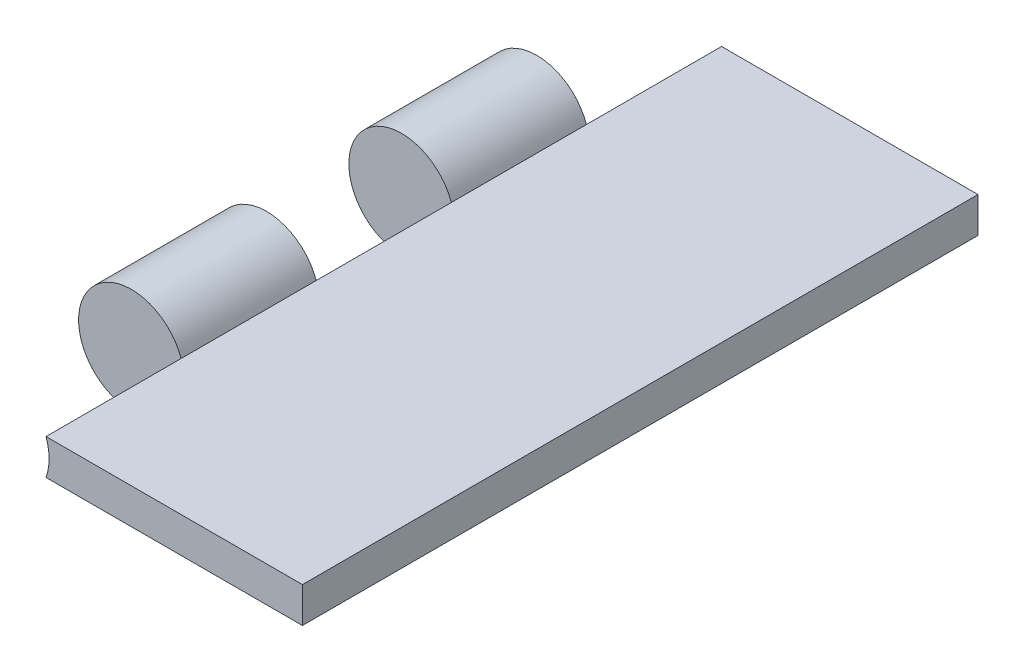
ISO-10303-21;
HEADER;
FILE_DESCRIPTION(('STEP AP214'),'2;1');
FILE_NAME('part.step','',(''),(''),'','','');
FILE_SCHEMA(('AUTOMOTIVE_DESIGN { 1 0 10303 214 1 1 1 1 }'));
ENDSEC;
DATA;
#1=APPLICATION_CONTEXT('core data for automotive mechanical design processes');
#2=APPLICATION_PROTOCOL_DEFINITION('international standard','automotive_design',2000,#1);
#3=PRODUCT_CONTEXT('',#1,'mechanical');
#4=PRODUCT('Part','Part','',(#3));
#5=PRODUCT_RELATED_PRODUCT_CATEGORY('part','',(#4));
#6=PRODUCT_DEFINITION_FORMATION('','',#4);
#7=PRODUCT_DEFINITION_CONTEXT('part definition',#1,'design');
#8=PRODUCT_DEFINITION('design','',#6,#7);
#9=PRODUCT_DEFINITION_SHAPE('','',#8);
#10=(LENGTH_UNIT() NAMED_UNIT(*) SI_UNIT(.MILLI.,.METRE.));
#11=(NAMED_UNIT(*) PLANE_ANGLE_UNIT() SI_UNIT($,.RADIAN.));
#12=(NAMED_UNIT(*) SI_UNIT($,.STERADIAN.) SOLID_ANGLE_UNIT());
#13=UNCERTAINTY_MEASURE_WITH_UNIT(LENGTH_MEASURE(1.E-05),#10,'distance_accuracy_value','');
#14=(GEOMETRIC_REPRESENTATION_CONTEXT(3) GLOBAL_UNCERTAINTY_ASSIGNED_CONTEXT((#13)) GLOBAL_UNIT_ASSIGNED_CONTEXT((#10,
#11,#12)) REPRESENTATION_CONTEXT('',''));
#15=CARTESIAN_POINT('',(0.,0.,0.));
#16=DIRECTION('',(0.,0.,1.));
#17=DIRECTION('',(1.,0.,0.));
#18=AXIS2_PLACEMENT_3D('',#15,#16,#17);
#19=CARTESIAN_POINT('',(0.,0.,101.6));
#20=DIRECTION('',(0.,0.,-1.));
#21=DIRECTION('',(-1.,0.,0.));
#22=AXIS2_PLACEMENT_3D('',#19,#20,#21);
#23=CYLINDRICAL_SURFACE('',#22,7.9375);
#24=CARTESIAN_POINT('',(0.,0.,81.28));
#25=DIRECTION('',(0.,0.,1.));
#26=DIRECTION('',(1.,0.,0.));
#27=AXIS2_PLACEMENT_3D('',#24,#25,#26);
#28=CIRCLE('',#27,7.9375);
#29=CARTESIAN_POINT('',(7.47602951104395,2.66699999999999,81.28));
#30=VERTEX_POINT('',#29);
#31=CARTESIAN_POINT('',(7.47602951104395,-2.66699999999999,81.28));
#32=VERTEX_POINT('',#31);
#33=EDGE_CURVE('E225',#30,#32,#28,.T.);
#34=ORIENTED_EDGE('',*,*,#33,.F.);
#35=DIRECTION('',(0.,0.,-1.));
#36=VECTOR('',#35,1.);
#37=CARTESIAN_POINT('',(7.47602951104395,2.66699999999999,101.6));
#38=LINE('',#37,#36);
#39=CARTESIAN_POINT('',(7.47602951104395,2.66699999999999,60.96));
#40=VERTEX_POINT('',#39);
#41=EDGE_CURVE('E128',#30,#40,#38,.T.);
#42=ORIENTED_EDGE('',*,*,#41,.T.);
#43=CARTESIAN_POINT('',(0.,0.,60.96));
#44=DIRECTION('',(0.,0.,1.));
#45=DIRECTION('',(1.,0.,0.));
#46=AXIS2_PLACEMENT_3D('',#43,#44,#45);
#47=CIRCLE('',#46,7.9375);
#48=CARTESIAN_POINT('',(7.47602951104395,-2.66699999999999,60.96));
#49=VERTEX_POINT('',#48);
#50=EDGE_CURVE('E164',#40,#49,#47,.T.);
#51=ORIENTED_EDGE('',*,*,#50,.T.);
#52=DIRECTION('',(0.,0.,-1.));
#53=VECTOR('',#52,1.);
#54=CARTESIAN_POINT('',(7.47602951104395,-2.66699999999999,101.6));
#55=LINE('',#54,#53);
#56=EDGE_CURVE('E52',#32,#49,#55,.T.);
#57=ORIENTED_EDGE('',*,*,#56,.F.);
#58=EDGE_LOOP('',(#34,#42,#51,#57));
#59=FACE_BOUND('',#58,.T.);
#60=ADVANCED_FACE('F37',(#59),#23,.T.);
#61=CARTESIAN_POINT('',(0.,0.,101.6));
#62=DIRECTION('',(0.,0.,1.));
#63=DIRECTION('',(1.,0.,0.));
#64=AXIS2_PLACEMENT_3D('',#61,#62,#63);
#65=PLANE('',#64);
#66=DIRECTION('',(-1.,0.,0.));
#67=VECTOR('',#66,1.);
#68=CARTESIAN_POINT('',(0.,2.66699999999999,101.6));
#69=LINE('',#68,#67);
#70=CARTESIAN_POINT('',(46.0375,2.667,101.6));
#71=VERTEX_POINT('',#70);
#72=CARTESIAN_POINT('',(7.47602951104395,2.66699999999999,101.6));
#73=VERTEX_POINT('',#72);
#74=EDGE_CURVE('E116',#71,#73,#69,.T.);
#75=ORIENTED_EDGE('',*,*,#74,.T.);
#76=CARTESIAN_POINT('',(0.,0.,101.6));
#77=DIRECTION('',(0.,0.,1.));
#78=DIRECTION('',(1.,0.,0.));
#79=AXIS2_PLACEMENT_3D('',#76,#77,#78);
#80=CIRCLE('',#79,7.9375);
#81=CARTESIAN_POINT('',(7.47602951104395,-2.66699999999999,101.6));
#82=VERTEX_POINT('',#81);
#83=EDGE_CURVE('E11',#73,#82,#80,.F.);
#84=ORIENTED_EDGE('',*,*,#83,.T.);
#85=DIRECTION('',(-1.,0.,0.));
#86=VECTOR('',#85,1.);
#87=CARTESIAN_POINT('',(0.,-2.66699999999999,101.6));
#88=LINE('',#87,#86);
#89=CARTESIAN_POINT('',(46.0375,-2.667,101.6));
#90=VERTEX_POINT('',#89);
#91=EDGE_CURVE('E167',#90,#82,#88,.T.);
#92=ORIENTED_EDGE('',*,*,#91,.F.);
#93=DIRECTION('',(0.,1.,0.));
#94=VECTOR('',#93,1.);
#95=CARTESIAN_POINT('',(46.0375,0.,101.6));
#96=LINE('',#95,#94);
#97=EDGE_CURVE('E118',#90,#71,#96,.T.);
#98=ORIENTED_EDGE('',*,*,#97,.T.);
#99=EDGE_LOOP('',(#75,#84,#92,#98));
#100=FACE_BOUND('',#99,.T.);
#101=ADVANCED_FACE('F117',(#100),#65,.T.);
#102=CARTESIAN_POINT('',(0.,0.,40.64));
#103=DIRECTION('',(0.,0.,1.));
#104=DIRECTION('',(1.,0.,0.));
#105=AXIS2_PLACEMENT_3D('',#102,#103,#104);
#106=CIRCLE('',#105,7.9375);
#107=CARTESIAN_POINT('',(7.47602951104395,2.66699999999999,40.64));
#108=VERTEX_POINT('',#107);
#109=CARTESIAN_POINT('',(7.47602951104395,-2.66699999999999,40.64));
#110=VERTEX_POINT('',#109);
#111=EDGE_CURVE('E159',#108,#110,#106,.T.);
#112=ORIENTED_EDGE('',*,*,#111,.F.);
#113=CARTESIAN_POINT('',(7.47602951104395,2.66699999999999,20.32));
#114=VERTEX_POINT('',#113);
#115=EDGE_CURVE('E133',#108,#114,#38,.T.);
#116=ORIENTED_EDGE('',*,*,#115,.T.);
#117=CARTESIAN_POINT('',(0.,0.,20.32));
#118=DIRECTION('',(0.,0.,1.));
#119=DIRECTION('',(1.,0.,0.));
#120=AXIS2_PLACEMENT_3D('',#117,#118,#119);
#121=CIRCLE('',#120,7.9375);
#122=CARTESIAN_POINT('',(7.47602951104395,-2.66699999999999,20.32));
#123=VERTEX_POINT('',#122);
#124=EDGE_CURVE('E158',#114,#123,#121,.T.);
#125=ORIENTED_EDGE('',*,*,#124,.T.);
#126=EDGE_CURVE('E122',#110,#123,#55,.T.);
#127=ORIENTED_EDGE('',*,*,#126,.F.);
#128=EDGE_LOOP('',(#112,#116,#125,#127));
#129=FACE_BOUND('',#128,.T.);
#130=ADVANCED_FACE('F161',(#129),#23,.T.);
#131=CARTESIAN_POINT('',(0.,0.,0.));
#132=DIRECTION('',(0.,0.,1.));
#133=DIRECTION('',(1.,0.,0.));
#134=AXIS2_PLACEMENT_3D('',#131,#132,#133);
#135=PLANE('',#134);
#136=CARTESIAN_POINT('',(0.,0.,0.));
#137=DIRECTION('',(0.,0.,1.));
#138=DIRECTION('',(1.,0.,0.));
#139=AXIS2_PLACEMENT_3D('',#136,#137,#138);
#140=CIRCLE('',#139,7.9375);
#141=CARTESIAN_POINT('',(7.47602951104395,2.66699999999999,0.));
#142=VERTEX_POINT('',#141);
#143=CARTESIAN_POINT('',(7.47602951104395,-2.66699999999999,0.));
#144=VERTEX_POINT('',#143);
#145=EDGE_CURVE('E45',#142,#144,#140,.F.);
#146=ORIENTED_EDGE('',*,*,#145,.F.);
#147=DIRECTION('',(-1.,0.,0.));
#148=VECTOR('',#147,1.);
#149=CARTESIAN_POINT('',(0.,2.66699999999999,0.));
#150=LINE('',#149,#148);
#151=CARTESIAN_POINT('',(46.0375,2.667,0.));
#152=VERTEX_POINT('',#151);
#153=EDGE_CURVE('E169',#152,#142,#150,.T.);
#154=ORIENTED_EDGE('',*,*,#153,.F.);
#155=DIRECTION('',(0.,1.,0.));
#156=VECTOR('',#155,1.);
#157=CARTESIAN_POINT('',(46.0375,0.,0.));
#158=LINE('',#157,#156);
#159=CARTESIAN_POINT('',(46.0375,-2.667,0.));
#160=VERTEX_POINT('',#159);
#161=EDGE_CURVE('E172',#160,#152,#158,.T.);
#162=ORIENTED_EDGE('',*,*,#161,.F.);
#163=DIRECTION('',(-1.,0.,0.));
#164=VECTOR('',#163,1.);
#165=CARTESIAN_POINT('',(0.,-2.66699999999999,0.));
#166=LINE('',#165,#164);
#167=EDGE_CURVE('E154',#160,#144,#166,.T.);
#168=ORIENTED_EDGE('',*,*,#167,.T.);
#169=EDGE_LOOP('',(#146,#154,#162,#168));
#170=FACE_BOUND('',#169,.T.);
#171=ADVANCED_FACE('F176',(#170),#135,.F.);
#172=CARTESIAN_POINT('',(0.,-2.66699999999999,101.6));
#173=DIRECTION('',(0.,-1.,0.));
#174=DIRECTION('',(1.,0.,0.));
#175=AXIS2_PLACEMENT_3D('',#172,#173,#174);
#176=PLANE('',#175);
#177=ORIENTED_EDGE('',*,*,#167,.F.);
#178=DIRECTION('',(0.,0.,-1.));
#179=VECTOR('',#178,1.);
#180=CARTESIAN_POINT('',(46.0375,-2.667,101.6));
#181=LINE('',#180,#179);
#182=EDGE_CURVE('E83',#90,#160,#181,.T.);
#183=ORIENTED_EDGE('',*,*,#182,.F.);
#184=ORIENTED_EDGE('',*,*,#91,.T.);
#185=EDGE_CURVE('E60',#82,#32,#55,.T.);
#186=ORIENTED_EDGE('',*,*,#185,.T.);
#187=ORIENTED_EDGE('',*,*,#56,.T.);
#188=EDGE_CURVE('E142',#49,#110,#55,.T.);
#189=ORIENTED_EDGE('',*,*,#188,.T.);
#190=ORIENTED_EDGE('',*,*,#126,.T.);
#191=DIRECTION('',(0.,0.,-1.));
#192=VECTOR('',#191,1.);
#193=CARTESIAN_POINT('',(7.47602951104395,-2.66699999999999,20.32));
#194=LINE('',#193,#192);
#195=EDGE_CURVE('E148',#123,#144,#194,.T.);
#196=ORIENTED_EDGE('',*,*,#195,.T.);
#197=EDGE_LOOP('',(#177,#183,#184,#186,#187,#189,#190,#196));
#198=FACE_BOUND('',#197,.T.);
#199=ADVANCED_FACE('F39',(#198),#176,.T.);
#200=CARTESIAN_POINT('',(46.0375,0.,101.6));
#201=DIRECTION('',(-1.,0.,0.));
#202=DIRECTION('',(0.,0.,1.));
#203=AXIS2_PLACEMENT_3D('',#200,#201,#202);
#204=PLANE('',#203);
#205=ORIENTED_EDGE('',*,*,#161,.T.);
#206=DIRECTION('',(0.,0.,-1.));
#207=VECTOR('',#206,1.);
#208=CARTESIAN_POINT('',(46.0375,2.667,101.6));
#209=LINE('',#208,#207);
#210=EDGE_CURVE('E129',#71,#152,#209,.T.);
#211=ORIENTED_EDGE('',*,*,#210,.F.);
#212=ORIENTED_EDGE('',*,*,#97,.F.);
#213=ORIENTED_EDGE('',*,*,#182,.T.);
#214=EDGE_LOOP('',(#205,#211,#212,#213));
#215=FACE_BOUND('',#214,.T.);
#216=ADVANCED_FACE('F179',(#215),#204,.F.);
#217=CARTESIAN_POINT('',(0.,2.66699999999999,101.6));
#218=DIRECTION('',(0.,-1.,0.));
#219=DIRECTION('',(1.,0.,0.));
#220=AXIS2_PLACEMENT_3D('',#217,#218,#219);
#221=PLANE('',#220);
#222=ORIENTED_EDGE('',*,*,#153,.T.);
#223=DIRECTION('',(0.,0.,-1.));
#224=VECTOR('',#223,1.);
#225=CARTESIAN_POINT('',(7.47602951104395,2.66699999999999,20.32));
#226=LINE('',#225,#224);
#227=EDGE_CURVE('E78',#114,#142,#226,.T.);
#228=ORIENTED_EDGE('',*,*,#227,.F.);
#229=ORIENTED_EDGE('',*,*,#115,.F.);
#230=EDGE_CURVE('E131',#40,#108,#38,.T.);
#231=ORIENTED_EDGE('',*,*,#230,.F.);
#232=ORIENTED_EDGE('',*,*,#41,.F.);
#233=EDGE_CURVE('E111',#73,#30,#38,.T.);
#234=ORIENTED_EDGE('',*,*,#233,.F.);
#235=ORIENTED_EDGE('',*,*,#74,.F.);
#236=ORIENTED_EDGE('',*,*,#210,.T.);
#237=EDGE_LOOP('',(#222,#228,#229,#231,#232,#234,#235,#236));
#238=FACE_BOUND('',#237,.T.);
#239=ADVANCED_FACE('F126',(#238),#221,.F.);
#240=CARTESIAN_POINT('',(0.,0.,20.32));
#241=DIRECTION('',(0.,0.,-1.));
#242=DIRECTION('',(-1.,0.,0.));
#243=AXIS2_PLACEMENT_3D('',#240,#241,#242);
#244=CYLINDRICAL_SURFACE('',#243,7.9375);
#245=EDGE_CURVE('E152',#123,#114,#121,.T.);
#246=ORIENTED_EDGE('',*,*,#245,.T.);
#247=ORIENTED_EDGE('',*,*,#227,.T.);
#248=ORIENTED_EDGE('',*,*,#145,.T.);
#249=ORIENTED_EDGE('',*,*,#195,.F.);
#250=EDGE_LOOP('',(#246,#247,#248,#249));
#251=FACE_BOUND('',#250,.T.);
#252=ADVANCED_FACE('F151',(#251),#244,.F.);
#253=CARTESIAN_POINT('',(0.,0.,20.32));
#254=DIRECTION('',(0.,0.,1.));
#255=DIRECTION('',(1.,0.,0.));
#256=AXIS2_PLACEMENT_3D('',#253,#254,#255);
#257=PLANE('',#256);
#258=ORIENTED_EDGE('',*,*,#124,.F.);
#259=ORIENTED_EDGE('',*,*,#245,.F.);
#260=EDGE_LOOP('',(#258,#259));
#261=FACE_BOUND('',#260,.T.);
#262=ADVANCED_FACE('F157',(#261),#257,.F.);
#263=CARTESIAN_POINT('',(0.,0.,40.64));
#264=DIRECTION('',(0.,0.,1.));
#265=DIRECTION('',(1.,0.,0.));
#266=AXIS2_PLACEMENT_3D('',#263,#264,#265);
#267=CYLINDRICAL_SURFACE('',#266,7.9375);
#268=ORIENTED_EDGE('',*,*,#188,.F.);
#269=EDGE_CURVE('E227',#49,#40,#47,.T.);
#270=ORIENTED_EDGE('',*,*,#269,.T.);
#271=ORIENTED_EDGE('',*,*,#230,.T.);
#272=EDGE_CURVE('E231',#110,#108,#106,.T.);
#273=ORIENTED_EDGE('',*,*,#272,.F.);
#274=EDGE_LOOP('',(#268,#270,#271,#273));
#275=FACE_BOUND('',#274,.T.);
#276=ADVANCED_FACE('F206',(#275),#267,.F.);
#277=CARTESIAN_POINT('',(0.,0.,40.64));
#278=DIRECTION('',(0.,0.,1.));
#279=DIRECTION('',(1.,0.,0.));
#280=AXIS2_PLACEMENT_3D('',#277,#278,#279);
#281=PLANE('',#280);
#282=ORIENTED_EDGE('',*,*,#111,.T.);
#283=ORIENTED_EDGE('',*,*,#272,.T.);
#284=EDGE_LOOP('',(#282,#283));
#285=FACE_BOUND('',#284,.T.);
#286=ADVANCED_FACE('F209',(#285),#281,.T.);
#287=CARTESIAN_POINT('',(0.,0.,60.96));
#288=DIRECTION('',(0.,0.,1.));
#289=DIRECTION('',(1.,0.,0.));
#290=AXIS2_PLACEMENT_3D('',#287,#288,#289);
#291=PLANE('',#290);
#292=ORIENTED_EDGE('',*,*,#50,.F.);
#293=ORIENTED_EDGE('',*,*,#269,.F.);
#294=EDGE_LOOP('',(#292,#293));
#295=FACE_BOUND('',#294,.T.);
#296=ADVANCED_FACE('F210',(#295),#291,.F.);
#297=CARTESIAN_POINT('',(0.,0.,101.6));
#298=DIRECTION('',(0.,0.,-1.));
#299=DIRECTION('',(-1.,0.,0.));
#300=AXIS2_PLACEMENT_3D('',#297,#298,#299);
#301=CYLINDRICAL_SURFACE('',#300,7.9375);
#302=ORIENTED_EDGE('',*,*,#83,.F.);
#303=ORIENTED_EDGE('',*,*,#233,.T.);
#304=EDGE_CURVE('E226',#32,#30,#28,.T.);
#305=ORIENTED_EDGE('',*,*,#304,.F.);
#306=ORIENTED_EDGE('',*,*,#185,.F.);
#307=EDGE_LOOP('',(#302,#303,#305,#306));
#308=FACE_BOUND('',#307,.T.);
#309=ADVANCED_FACE('F109',(#308),#301,.F.);
#310=CARTESIAN_POINT('',(0.,0.,81.28));
#311=DIRECTION('',(0.,0.,1.));
#312=DIRECTION('',(1.,0.,0.));
#313=AXIS2_PLACEMENT_3D('',#310,#311,#312);
#314=PLANE('',#313);
#315=ORIENTED_EDGE('',*,*,#33,.T.);
#316=ORIENTED_EDGE('',*,*,#304,.T.);
#317=EDGE_LOOP('',(#315,#316));
#318=FACE_BOUND('',#317,.T.);
#319=ADVANCED_FACE('F219',(#318),#314,.T.);
#320=CLOSED_SHELL('',(#60,#101,#130,#171,#199,#216,#239,#252,#262,#276,#286,#296,#309,#319));
#321=MANIFOLD_SOLID_BREP('B2',#320);
#322=ADVANCED_BREP_SHAPE_REPRESENTATION('',(#18,#321),#14);
#323=SHAPE_DEFINITION_REPRESENTATION(#9,#322);
ENDSEC;
END-ISO-10303-21;
